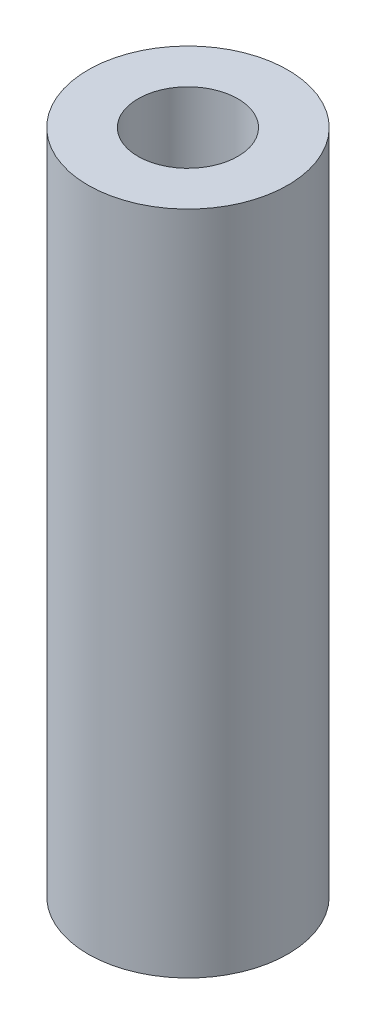
ISO-10303-21;
HEADER;
FILE_DESCRIPTION(('STEP AP214'),'2;1');
FILE_NAME('part.step','',(''),(''),'','','');
FILE_SCHEMA(('AUTOMOTIVE_DESIGN { 1 0 10303 214 1 1 1 1 }'));
ENDSEC;
DATA;
#1=APPLICATION_CONTEXT('core data for automotive mechanical design processes');
#2=APPLICATION_PROTOCOL_DEFINITION('international standard','automotive_design',2000,#1);
#3=PRODUCT_CONTEXT('',#1,'mechanical');
#4=PRODUCT('Part','Part','',(#3));
#5=PRODUCT_RELATED_PRODUCT_CATEGORY('part','',(#4));
#6=PRODUCT_DEFINITION_FORMATION('','',#4);
#7=PRODUCT_DEFINITION_CONTEXT('part definition',#1,'design');
#8=PRODUCT_DEFINITION('design','',#6,#7);
#9=PRODUCT_DEFINITION_SHAPE('','',#8);
#10=(LENGTH_UNIT() NAMED_UNIT(*) SI_UNIT(.MILLI.,.METRE.));
#11=(NAMED_UNIT(*) PLANE_ANGLE_UNIT() SI_UNIT($,.RADIAN.));
#12=(NAMED_UNIT(*) SI_UNIT($,.STERADIAN.) SOLID_ANGLE_UNIT());
#13=UNCERTAINTY_MEASURE_WITH_UNIT(LENGTH_MEASURE(1.E-05),#10,'distance_accuracy_value','');
#14=(GEOMETRIC_REPRESENTATION_CONTEXT(3) GLOBAL_UNCERTAINTY_ASSIGNED_CONTEXT((#13)) GLOBAL_UNIT_ASSIGNED_CONTEXT((#10,
#11,#12)) REPRESENTATION_CONTEXT('',''));
#15=CARTESIAN_POINT('',(0.,0.,0.));
#16=DIRECTION('',(0.,0.,1.));
#17=DIRECTION('',(1.,0.,0.));
#18=AXIS2_PLACEMENT_3D('',#15,#16,#17);
#19=CARTESIAN_POINT('',(0.,20.,0.));
#20=DIRECTION('',(0.,1.,0.));
#21=DIRECTION('',(0.,0.,1.));
#22=AXIS2_PLACEMENT_3D('',#19,#20,#21);
#23=PLANE('',#22);
#24=CARTESIAN_POINT('',(0.,20.,0.));
#25=DIRECTION('',(0.,1.,0.));
#26=DIRECTION('',(0.,0.,1.));
#27=AXIS2_PLACEMENT_3D('',#24,#25,#26);
#28=CIRCLE('',#27,3.);
#29=CARTESIAN_POINT('',(0.,20.,3.));
#30=VERTEX_POINT('',#29);
#31=EDGE_CURVE('E10',#30,#30,#28,.T.);
#32=ORIENTED_EDGE('',*,*,#31,.T.);
#33=EDGE_LOOP('',(#32));
#34=FACE_BOUND('',#33,.T.);
#35=CARTESIAN_POINT('',(0.,20.,0.));
#36=DIRECTION('',(0.,1.,0.));
#37=DIRECTION('',(0.,0.,1.));
#38=AXIS2_PLACEMENT_3D('',#35,#36,#37);
#39=CIRCLE('',#38,1.5);
#40=CARTESIAN_POINT('',(0.,20.,1.5));
#41=VERTEX_POINT('',#40);
#42=EDGE_CURVE('E43',#41,#41,#39,.T.);
#43=ORIENTED_EDGE('',*,*,#42,.F.);
#44=EDGE_LOOP('',(#43));
#45=FACE_BOUND('',#44,.T.);
#46=ADVANCED_FACE('F32',(#34,#45),#23,.T.);
#47=CARTESIAN_POINT('',(0.,0.,0.));
#48=DIRECTION('',(0.,1.,0.));
#49=DIRECTION('',(0.,0.,1.));
#50=AXIS2_PLACEMENT_3D('',#47,#48,#49);
#51=PLANE('',#50);
#52=CARTESIAN_POINT('',(0.,0.,0.));
#53=DIRECTION('',(0.,1.,0.));
#54=DIRECTION('',(0.,0.,1.));
#55=AXIS2_PLACEMENT_3D('',#52,#53,#54);
#56=CIRCLE('',#55,3.);
#57=CARTESIAN_POINT('',(0.,0.,3.));
#58=VERTEX_POINT('',#57);
#59=EDGE_CURVE('E36',#58,#58,#56,.T.);
#60=ORIENTED_EDGE('',*,*,#59,.F.);
#61=EDGE_LOOP('',(#60));
#62=FACE_BOUND('',#61,.T.);
#63=CARTESIAN_POINT('',(0.,0.,0.));
#64=DIRECTION('',(0.,1.,0.));
#65=DIRECTION('',(0.,0.,1.));
#66=AXIS2_PLACEMENT_3D('',#63,#64,#65);
#67=CIRCLE('',#66,1.5);
#68=CARTESIAN_POINT('',(0.,0.,1.5));
#69=VERTEX_POINT('',#68);
#70=EDGE_CURVE('E45',#69,#69,#67,.T.);
#71=ORIENTED_EDGE('',*,*,#70,.T.);
#72=EDGE_LOOP('',(#71));
#73=FACE_BOUND('',#72,.T.);
#74=ADVANCED_FACE('F55',(#62,#73),#51,.F.);
#75=CARTESIAN_POINT('',(0.,20.,0.));
#76=DIRECTION('',(0.,-1.,0.));
#77=DIRECTION('',(0.,0.,-1.));
#78=AXIS2_PLACEMENT_3D('',#75,#76,#77);
#79=CYLINDRICAL_SURFACE('',#78,3.);
#80=ORIENTED_EDGE('',*,*,#31,.F.);
#81=EDGE_LOOP('',(#80));
#82=FACE_BOUND('',#81,.T.);
#83=ORIENTED_EDGE('',*,*,#59,.T.);
#84=EDGE_LOOP('',(#83));
#85=FACE_BOUND('',#84,.T.);
#86=ADVANCED_FACE('F34',(#82,#85),#79,.T.);
#87=CARTESIAN_POINT('',(0.,20.,0.));
#88=DIRECTION('',(0.,-1.,0.));
#89=DIRECTION('',(0.,0.,-1.));
#90=AXIS2_PLACEMENT_3D('',#87,#88,#89);
#91=CYLINDRICAL_SURFACE('',#90,1.5);
#92=ORIENTED_EDGE('',*,*,#42,.T.);
#93=EDGE_LOOP('',(#92));
#94=FACE_BOUND('',#93,.T.);
#95=ORIENTED_EDGE('',*,*,#70,.F.);
#96=EDGE_LOOP('',(#95));
#97=FACE_BOUND('',#96,.T.);
#98=ADVANCED_FACE('F51',(#94,#97),#91,.F.);
#99=CLOSED_SHELL('',(#46,#74,#86,#98));
#100=MANIFOLD_SOLID_BREP('B2',#99);
#101=ADVANCED_BREP_SHAPE_REPRESENTATION('',(#18,#100),#14);
#102=SHAPE_DEFINITION_REPRESENTATION(#9,#101);
ENDSEC;
END-ISO-10303-21;
